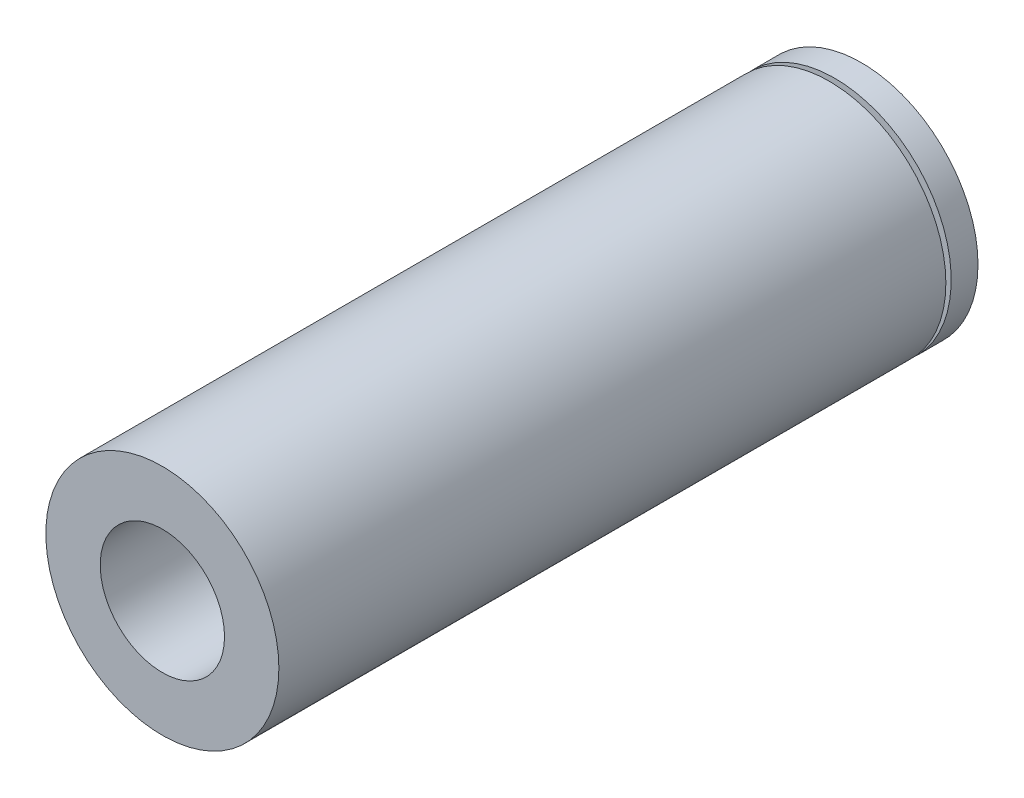
ISO-10303-21;
HEADER;
FILE_DESCRIPTION(('STEP AP214'),'2;1');
FILE_NAME('part.step','',(''),(''),'','','');
FILE_SCHEMA(('AUTOMOTIVE_DESIGN { 1 0 10303 214 1 1 1 1 }'));
ENDSEC;
DATA;
#1=APPLICATION_CONTEXT('core data for automotive mechanical design processes');
#2=APPLICATION_PROTOCOL_DEFINITION('international standard','automotive_design',2000,#1);
#3=PRODUCT_CONTEXT('',#1,'mechanical');
#4=PRODUCT('Part','Part','',(#3));
#5=PRODUCT_RELATED_PRODUCT_CATEGORY('part','',(#4));
#6=PRODUCT_DEFINITION_FORMATION('','',#4);
#7=PRODUCT_DEFINITION_CONTEXT('part definition',#1,'design');
#8=PRODUCT_DEFINITION('design','',#6,#7);
#9=PRODUCT_DEFINITION_SHAPE('','',#8);
#10=(LENGTH_UNIT() NAMED_UNIT(*) SI_UNIT(.MILLI.,.METRE.));
#11=(NAMED_UNIT(*) PLANE_ANGLE_UNIT() SI_UNIT($,.RADIAN.));
#12=(NAMED_UNIT(*) SI_UNIT($,.STERADIAN.) SOLID_ANGLE_UNIT());
#13=UNCERTAINTY_MEASURE_WITH_UNIT(LENGTH_MEASURE(1.E-05),#10,'distance_accuracy_value','');
#14=(GEOMETRIC_REPRESENTATION_CONTEXT(3) GLOBAL_UNCERTAINTY_ASSIGNED_CONTEXT((#13)) GLOBAL_UNIT_ASSIGNED_CONTEXT((#10,
#11,#12)) REPRESENTATION_CONTEXT('',''));
#15=CARTESIAN_POINT('',(0.,0.,0.));
#16=DIRECTION('',(0.,0.,1.));
#17=DIRECTION('',(1.,0.,0.));
#18=AXIS2_PLACEMENT_3D('',#15,#16,#17);
#19=CARTESIAN_POINT('',(0.,0.,45.));
#20=DIRECTION('',(0.,0.,-1.));
#21=DIRECTION('',(-1.,0.,0.));
#22=AXIS2_PLACEMENT_3D('',#19,#20,#21);
#23=CYLINDRICAL_SURFACE('',#22,7.5);
#24=CARTESIAN_POINT('',(0.,0.,1.7255544610059));
#25=DIRECTION('',(0.,0.,-1.));
#26=DIRECTION('',(-1.,0.,0.));
#27=AXIS2_PLACEMENT_3D('',#24,#25,#26);
#28=CIRCLE('',#27,7.5);
#29=CARTESIAN_POINT('',(-7.5,0.,1.7255544610059));
#30=VERTEX_POINT('',#29);
#31=EDGE_CURVE('E36',#30,#30,#28,.T.);
#32=ORIENTED_EDGE('',*,*,#31,.T.);
#33=EDGE_LOOP('',(#32));
#34=FACE_BOUND('',#33,.T.);
#35=CARTESIAN_POINT('',(0.,0.,0.));
#36=DIRECTION('',(0.,0.,1.));
#37=DIRECTION('',(1.,0.,0.));
#38=AXIS2_PLACEMENT_3D('',#35,#36,#37);
#39=CIRCLE('',#38,7.5);
#40=CARTESIAN_POINT('',(7.5,0.,0.));
#41=VERTEX_POINT('',#40);
#42=EDGE_CURVE('E40',#41,#41,#39,.T.);
#43=ORIENTED_EDGE('',*,*,#42,.T.);
#44=EDGE_LOOP('',(#43));
#45=FACE_BOUND('',#44,.T.);
#46=ADVANCED_FACE('F32',(#34,#45),#23,.T.);
#47=CARTESIAN_POINT('',(0.,0.,45.));
#48=DIRECTION('',(0.,0.,1.));
#49=DIRECTION('',(1.,0.,0.));
#50=AXIS2_PLACEMENT_3D('',#47,#48,#49);
#51=PLANE('',#50);
#52=CARTESIAN_POINT('',(0.,0.,45.));
#53=DIRECTION('',(0.,0.,1.));
#54=DIRECTION('',(1.,0.,0.));
#55=AXIS2_PLACEMENT_3D('',#52,#53,#54);
#56=CIRCLE('',#55,7.5);
#57=CARTESIAN_POINT('',(7.5,0.,45.));
#58=VERTEX_POINT('',#57);
#59=EDGE_CURVE('E10',#58,#58,#56,.T.);
#60=ORIENTED_EDGE('',*,*,#59,.T.);
#61=EDGE_LOOP('',(#60));
#62=FACE_BOUND('',#61,.T.);
#63=CARTESIAN_POINT('',(0.,0.,45.));
#64=DIRECTION('',(0.,0.,1.));
#65=DIRECTION('',(1.,0.,0.));
#66=AXIS2_PLACEMENT_3D('',#63,#64,#65);
#67=CIRCLE('',#66,4.);
#68=CARTESIAN_POINT('',(4.,0.,45.));
#69=VERTEX_POINT('',#68);
#70=EDGE_CURVE('E45',#69,#69,#67,.T.);
#71=ORIENTED_EDGE('',*,*,#70,.F.);
#72=EDGE_LOOP('',(#71));
#73=FACE_BOUND('',#72,.T.);
#74=ADVANCED_FACE('F84',(#62,#73),#51,.T.);
#75=CARTESIAN_POINT('',(0.,0.,0.));
#76=DIRECTION('',(0.,0.,1.));
#77=DIRECTION('',(1.,0.,0.));
#78=AXIS2_PLACEMENT_3D('',#75,#76,#77);
#79=PLANE('',#78);
#80=ORIENTED_EDGE('',*,*,#42,.F.);
#81=EDGE_LOOP('',(#80));
#82=FACE_BOUND('',#81,.T.);
#83=CARTESIAN_POINT('',(0.,0.,0.));
#84=DIRECTION('',(0.,0.,1.));
#85=DIRECTION('',(1.,0.,0.));
#86=AXIS2_PLACEMENT_3D('',#83,#84,#85);
#87=CIRCLE('',#86,4.);
#88=CARTESIAN_POINT('',(4.,0.,0.));
#89=VERTEX_POINT('',#88);
#90=EDGE_CURVE('E48',#89,#89,#87,.T.);
#91=ORIENTED_EDGE('',*,*,#90,.T.);
#92=EDGE_LOOP('',(#91));
#93=FACE_BOUND('',#92,.T.);
#94=ADVANCED_FACE('F69',(#82,#93),#79,.F.);
#95=CARTESIAN_POINT('',(0.,0.,2.06803597897237));
#96=DIRECTION('',(0.,0.,1.));
#97=DIRECTION('',(1.,0.,0.));
#98=AXIS2_PLACEMENT_3D('',#95,#96,#97);
#99=CIRCLE('',#98,7.5);
#100=CARTESIAN_POINT('',(7.5,0.,2.06803597897237));
#101=VERTEX_POINT('',#100);
#102=EDGE_CURVE('E50',#101,#101,#99,.T.);
#103=ORIENTED_EDGE('',*,*,#102,.T.);
#104=EDGE_LOOP('',(#103));
#105=FACE_BOUND('',#104,.T.);
#106=ORIENTED_EDGE('',*,*,#59,.F.);
#107=EDGE_LOOP('',(#106));
#108=FACE_BOUND('',#107,.T.);
#109=ADVANCED_FACE('F34',(#105,#108),#23,.T.);
#110=CARTESIAN_POINT('',(0.,0.,45.));
#111=DIRECTION('',(0.,0.,-1.));
#112=DIRECTION('',(-1.,0.,0.));
#113=AXIS2_PLACEMENT_3D('',#110,#111,#112);
#114=CYLINDRICAL_SURFACE('',#113,4.);
#115=ORIENTED_EDGE('',*,*,#70,.T.);
#116=EDGE_LOOP('',(#115));
#117=FACE_BOUND('',#116,.T.);
#118=ORIENTED_EDGE('',*,*,#90,.F.);
#119=EDGE_LOOP('',(#118));
#120=FACE_BOUND('',#119,.T.);
#121=ADVANCED_FACE('F71',(#117,#120),#114,.F.);
#122=CARTESIAN_POINT('',(6.9859324795846,0.,1.7255544610059));
#123=DIRECTION('',(0.,0.,-1.));
#124=DIRECTION('',(-1.,0.,0.));
#125=AXIS2_PLACEMENT_3D('',#122,#123,#124);
#126=PLANE('',#125);
#127=CARTESIAN_POINT('',(0.,0.,1.7255544610059));
#128=DIRECTION('',(0.,0.,1.));
#129=DIRECTION('',(1.,0.,0.));
#130=AXIS2_PLACEMENT_3D('',#127,#128,#129);
#131=CIRCLE('',#130,6.9859324795846);
#132=CARTESIAN_POINT('',(6.9859324795846,0.,1.7255544610059));
#133=VERTEX_POINT('',#132);
#134=EDGE_CURVE('E52',#133,#133,#131,.T.);
#135=ORIENTED_EDGE('',*,*,#134,.F.);
#136=EDGE_LOOP('',(#135));
#137=FACE_BOUND('',#136,.T.);
#138=ORIENTED_EDGE('',*,*,#31,.F.);
#139=EDGE_LOOP('',(#138));
#140=FACE_BOUND('',#139,.T.);
#141=ADVANCED_FACE('F73',(#137,#140),#126,.F.);
#142=CARTESIAN_POINT('',(6.9859324795846,0.,2.06803597897237));
#143=DIRECTION('',(0.,0.,1.));
#144=DIRECTION('',(1.,0.,0.));
#145=AXIS2_PLACEMENT_3D('',#142,#143,#144);
#146=PLANE('',#145);
#147=CARTESIAN_POINT('',(0.,0.,2.06803597897237));
#148=DIRECTION('',(0.,0.,1.));
#149=DIRECTION('',(1.,0.,0.));
#150=AXIS2_PLACEMENT_3D('',#147,#148,#149);
#151=CIRCLE('',#150,6.9859324795846);
#152=CARTESIAN_POINT('',(6.9859324795846,0.,2.06803597897237));
#153=VERTEX_POINT('',#152);
#154=EDGE_CURVE('E57',#153,#153,#151,.T.);
#155=ORIENTED_EDGE('',*,*,#154,.T.);
#156=EDGE_LOOP('',(#155));
#157=FACE_BOUND('',#156,.T.);
#158=ORIENTED_EDGE('',*,*,#102,.F.);
#159=EDGE_LOOP('',(#158));
#160=FACE_BOUND('',#159,.T.);
#161=ADVANCED_FACE('F79',(#157,#160),#146,.F.);
#162=CARTESIAN_POINT('',(0.,0.,0.));
#163=DIRECTION('',(0.,0.,1.));
#164=DIRECTION('',(1.,0.,0.));
#165=AXIS2_PLACEMENT_3D('',#162,#163,#164);
#166=CYLINDRICAL_SURFACE('',#165,6.9859324795846);
#167=ORIENTED_EDGE('',*,*,#154,.F.);
#168=EDGE_LOOP('',(#167));
#169=FACE_BOUND('',#168,.T.);
#170=ORIENTED_EDGE('',*,*,#134,.T.);
#171=EDGE_LOOP('',(#170));
#172=FACE_BOUND('',#171,.T.);
#173=ADVANCED_FACE('F121',(#169,#172),#166,.T.);
#174=CLOSED_SHELL('',(#46,#74,#94,#109,#121,#141,#161,#173));
#175=MANIFOLD_SOLID_BREP('B2',#174);
#176=ADVANCED_BREP_SHAPE_REPRESENTATION('',(#18,#175),#14);
#177=SHAPE_DEFINITION_REPRESENTATION(#9,#176);
ENDSEC;
END-ISO-10303-21;
